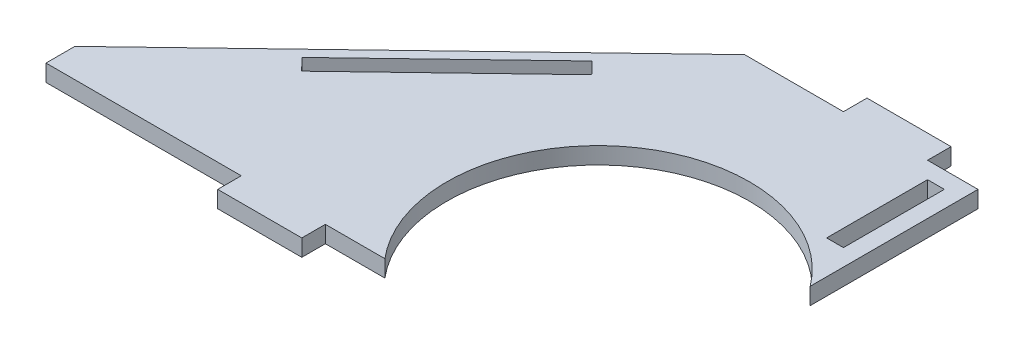
ISO-10303-21;
HEADER;
FILE_DESCRIPTION(('STEP AP214'),'2;1');
FILE_NAME('part.step','',(''),(''),'','','');
FILE_SCHEMA(('AUTOMOTIVE_DESIGN { 1 0 10303 214 1 1 1 1 }'));
ENDSEC;
DATA;
#1=APPLICATION_CONTEXT('core data for automotive mechanical design processes');
#2=APPLICATION_PROTOCOL_DEFINITION('international standard','automotive_design',2000,#1);
#3=PRODUCT_CONTEXT('',#1,'mechanical');
#4=PRODUCT('Part','Part','',(#3));
#5=PRODUCT_RELATED_PRODUCT_CATEGORY('part','',(#4));
#6=PRODUCT_DEFINITION_FORMATION('','',#4);
#7=PRODUCT_DEFINITION_CONTEXT('part definition',#1,'design');
#8=PRODUCT_DEFINITION('design','',#6,#7);
#9=PRODUCT_DEFINITION_SHAPE('','',#8);
#10=(LENGTH_UNIT() NAMED_UNIT(*) SI_UNIT(.MILLI.,.METRE.));
#11=(NAMED_UNIT(*) PLANE_ANGLE_UNIT() SI_UNIT($,.RADIAN.));
#12=(NAMED_UNIT(*) SI_UNIT($,.STERADIAN.) SOLID_ANGLE_UNIT());
#13=UNCERTAINTY_MEASURE_WITH_UNIT(LENGTH_MEASURE(1.E-05),#10,'distance_accuracy_value','');
#14=(GEOMETRIC_REPRESENTATION_CONTEXT(3) GLOBAL_UNCERTAINTY_ASSIGNED_CONTEXT((#13)) GLOBAL_UNIT_ASSIGNED_CONTEXT((#10,
#11,#12)) REPRESENTATION_CONTEXT('',''));
#15=CARTESIAN_POINT('',(0.,0.,0.));
#16=DIRECTION('',(0.,0.,1.));
#17=DIRECTION('',(1.,0.,0.));
#18=AXIS2_PLACEMENT_3D('',#15,#16,#17);
#19=CARTESIAN_POINT('',(0.,5.,0.));
#20=DIRECTION('',(0.,1.,0.));
#21=DIRECTION('',(0.,0.,1.));
#22=AXIS2_PLACEMENT_3D('',#19,#20,#21);
#23=PLANE('',#22);
#24=DIRECTION('',(0.722105065771253,0.,-0.691783401063869));
#25=VECTOR('',#24,1.);
#26=CARTESIAN_POINT('',(-19.5152016277213,5.,-20.3705754333702));
#27=LINE('',#26,#25);
#28=CARTESIAN_POINT('',(-44.4256575245917,5.,3.49387410346132));
#29=VERTEX_POINT('',#28);
#30=CARTESIAN_POINT('',(-0.377248512545201,5.,-38.7049133614347));
#31=VERTEX_POINT('',#30);
#32=EDGE_CURVE('E441',#29,#31,#27,.T.);
#33=ORIENTED_EDGE('',*,*,#32,.T.);
#34=DIRECTION('',(0.691783401063868,0.,0.722105065771255));
#35=VECTOR('',#34,1.);
#36=CARTESIAN_POINT('',(19.1379531151761,5.,-18.3343379280644));
#37=LINE('',#36,#35);
#38=CARTESIAN_POINT('',(3.08166849277414,5.,-35.0943880325784));
#39=VERTEX_POINT('',#38);
#40=EDGE_CURVE('E438',#31,#39,#37,.T.);
#41=ORIENTED_EDGE('',*,*,#40,.T.);
#42=DIRECTION('',(-0.722105065771254,0.,0.691783401063869));
#43=VECTOR('',#42,1.);
#44=CARTESIAN_POINT('',(-16.0562846224019,5.,-16.760050104514));
#45=LINE('',#44,#43);
#46=CARTESIAN_POINT('',(-40.9667405192723,5.,7.10439943231761));
#47=VERTEX_POINT('',#46);
#48=EDGE_CURVE('E419',#39,#47,#45,.T.);
#49=ORIENTED_EDGE('',*,*,#48,.T.);
#50=DIRECTION('',(0.691783401063868,0.,0.722105065771254));
#51=VECTOR('',#50,1.);
#52=CARTESIAN_POINT('',(-24.9104558968704,5.,23.8644495368316));
#53=LINE('',#52,#51);
#54=EDGE_CURVE('E428',#29,#47,#53,.T.);
#55=ORIENTED_EDGE('',*,*,#54,.F.);
#56=EDGE_LOOP('',(#33,#41,#49,#55));
#57=FACE_BOUND('',#56,.T.);
#58=DIRECTION('',(1.,0.,0.));
#59=VECTOR('',#58,1.);
#60=CARTESIAN_POINT('',(0.,5.,-28.));
#61=LINE('',#60,#59);
#62=CARTESIAN_POINT('',(80.,5.,-28.));
#63=VERTEX_POINT('',#62);
#64=CARTESIAN_POINT('',(85.,5.,-28.));
#65=VERTEX_POINT('',#64);
#66=EDGE_CURVE('E392',#63,#65,#61,.T.);
#67=ORIENTED_EDGE('',*,*,#66,.F.);
#68=DIRECTION('',(0.,0.,-1.));
#69=VECTOR('',#68,1.);
#70=CARTESIAN_POINT('',(80.,5.,0.));
#71=LINE('',#70,#69);
#72=CARTESIAN_POINT('',(80.,5.,-58.));
#73=VERTEX_POINT('',#72);
#74=EDGE_CURVE('E402',#63,#73,#71,.T.);
#75=ORIENTED_EDGE('',*,*,#74,.T.);
#76=DIRECTION('',(1.,0.,0.));
#77=VECTOR('',#76,1.);
#78=CARTESIAN_POINT('',(0.,5.,-58.));
#79=LINE('',#78,#77);
#80=CARTESIAN_POINT('',(85.,5.,-58.));
#81=VERTEX_POINT('',#80);
#82=EDGE_CURVE('E412',#73,#81,#79,.T.);
#83=ORIENTED_EDGE('',*,*,#82,.T.);
#84=DIRECTION('',(0.,0.,-1.));
#85=VECTOR('',#84,1.);
#86=CARTESIAN_POINT('',(85.,5.,0.));
#87=LINE('',#86,#85);
#88=EDGE_CURVE('E115',#65,#81,#87,.T.);
#89=ORIENTED_EDGE('',*,*,#88,.F.);
#90=EDGE_LOOP('',(#67,#75,#83,#89));
#91=FACE_BOUND('',#90,.T.);
#92=DIRECTION('',(-0.722105065771254,0.,0.691783401063869));
#93=VECTOR('',#92,1.);
#94=CARTESIAN_POINT('',(-21.5905518309129,5.,-22.536890630684));
#95=LINE('',#94,#93);
#96=CARTESIAN_POINT('',(20.6461023118507,5.,-63.));
#97=VERTEX_POINT('',#96);
#98=CARTESIAN_POINT('',(-81.0413439384418,5.,34.4175237745952));
#99=VERTEX_POINT('',#98);
#100=EDGE_CURVE('E260',#97,#99,#95,.T.);
#101=ORIENTED_EDGE('',*,*,#100,.T.);
#102=DIRECTION('',(0.,0.,1.));
#103=VECTOR('',#102,1.);
#104=CARTESIAN_POINT('',(-81.0413439384418,5.,0.));
#105=LINE('',#104,#103);
#106=CARTESIAN_POINT('',(-81.0413439384418,5.,43.));
#107=VERTEX_POINT('',#106);
#108=EDGE_CURVE('E107',#99,#107,#105,.T.);
#109=ORIENTED_EDGE('',*,*,#108,.T.);
#110=DIRECTION('',(1.,0.,0.));
#111=VECTOR('',#110,1.);
#112=CARTESIAN_POINT('',(0.,5.,43.));
#113=LINE('',#112,#111);
#114=CARTESIAN_POINT('',(-23.,5.,43.));
#115=VERTEX_POINT('',#114);
#116=EDGE_CURVE('E290',#107,#115,#113,.T.);
#117=ORIENTED_EDGE('',*,*,#116,.T.);
#118=DIRECTION('',(0.,0.,1.));
#119=VECTOR('',#118,1.);
#120=CARTESIAN_POINT('',(-23.,5.,0.));
#121=LINE('',#120,#119);
#122=CARTESIAN_POINT('',(-23.,5.,50.));
#123=VERTEX_POINT('',#122);
#124=EDGE_CURVE('E292',#115,#123,#121,.T.);
#125=ORIENTED_EDGE('',*,*,#124,.T.);
#126=DIRECTION('',(1.,0.,0.));
#127=VECTOR('',#126,1.);
#128=CARTESIAN_POINT('',(0.,5.,50.));
#129=LINE('',#128,#127);
#130=CARTESIAN_POINT('',(2.00000000000002,5.,50.));
#131=VERTEX_POINT('',#130);
#132=EDGE_CURVE('E294',#123,#131,#129,.T.);
#133=ORIENTED_EDGE('',*,*,#132,.T.);
#134=DIRECTION('',(0.,0.,1.));
#135=VECTOR('',#134,1.);
#136=CARTESIAN_POINT('',(2.00000000000002,5.,0.));
#137=LINE('',#136,#135);
#138=CARTESIAN_POINT('',(2.00000000000002,5.,43.));
#139=VERTEX_POINT('',#138);
#140=EDGE_CURVE('E296',#139,#131,#137,.T.);
#141=ORIENTED_EDGE('',*,*,#140,.F.);
#142=DIRECTION('',(-1.,0.,0.));
#143=VECTOR('',#142,1.);
#144=CARTESIAN_POINT('',(0.,5.,43.));
#145=LINE('',#144,#143);
#146=CARTESIAN_POINT('',(19.6906989318297,5.,43.));
#147=VERTEX_POINT('',#146);
#148=EDGE_CURVE('E299',#147,#139,#145,.T.);
#149=ORIENTED_EDGE('',*,*,#148,.F.);
#150=CARTESIAN_POINT('',(54.1000000000003,5.,14.));
#151=DIRECTION('',(0.,1.,0.));
#152=DIRECTION('',(0.,0.,1.));
#153=AXIS2_PLACEMENT_3D('',#150,#151,#152);
#154=CIRCLE('',#153,45.);
#155=CARTESIAN_POINT('',(90.,5.,-13.1328214529934));
#156=VERTEX_POINT('',#155);
#157=EDGE_CURVE('E270',#156,#147,#154,.T.);
#158=ORIENTED_EDGE('',*,*,#157,.F.);
#159=DIRECTION('',(0.,0.,1.));
#160=VECTOR('',#159,1.);
#161=CARTESIAN_POINT('',(90.,5.,0.));
#162=LINE('',#161,#160);
#163=CARTESIAN_POINT('',(90.,5.,-63.));
#164=VERTEX_POINT('',#163);
#165=EDGE_CURVE('E273',#164,#156,#162,.T.);
#166=ORIENTED_EDGE('',*,*,#165,.F.);
#167=DIRECTION('',(1.,0.,0.));
#168=VECTOR('',#167,1.);
#169=CARTESIAN_POINT('',(0.,5.,-63.));
#170=LINE('',#169,#168);
#171=CARTESIAN_POINT('',(75.,5.,-63.));
#172=VERTEX_POINT('',#171);
#173=EDGE_CURVE('E277',#172,#164,#170,.T.);
#174=ORIENTED_EDGE('',*,*,#173,.F.);
#175=DIRECTION('',(0.,0.,-1.));
#176=VECTOR('',#175,1.);
#177=CARTESIAN_POINT('',(75.,5.,0.));
#178=LINE('',#177,#176);
#179=CARTESIAN_POINT('',(75.,5.,-70.));
#180=VERTEX_POINT('',#179);
#181=EDGE_CURVE('E280',#172,#180,#178,.T.);
#182=ORIENTED_EDGE('',*,*,#181,.T.);
#183=DIRECTION('',(1.,0.,0.));
#184=VECTOR('',#183,1.);
#185=CARTESIAN_POINT('',(0.,5.,-70.));
#186=LINE('',#185,#184);
#187=CARTESIAN_POINT('',(50.,5.,-70.));
#188=VERTEX_POINT('',#187);
#189=EDGE_CURVE('E282',#188,#180,#186,.T.);
#190=ORIENTED_EDGE('',*,*,#189,.F.);
#191=DIRECTION('',(0.,0.,-1.));
#192=VECTOR('',#191,1.);
#193=CARTESIAN_POINT('',(50.,5.,0.));
#194=LINE('',#193,#192);
#195=CARTESIAN_POINT('',(50.,5.,-63.));
#196=VERTEX_POINT('',#195);
#197=EDGE_CURVE('E285',#196,#188,#194,.T.);
#198=ORIENTED_EDGE('',*,*,#197,.F.);
#199=DIRECTION('',(1.,0.,0.));
#200=VECTOR('',#199,1.);
#201=CARTESIAN_POINT('',(0.,5.,-63.));
#202=LINE('',#201,#200);
#203=EDGE_CURVE('E288',#97,#196,#202,.T.);
#204=ORIENTED_EDGE('',*,*,#203,.F.);
#205=EDGE_LOOP('',(#101,#109,#117,#125,#133,#141,#149,#158,#166,#174,#182,#190,#198,#204));
#206=FACE_BOUND('',#205,.T.);
#207=ADVANCED_FACE('F92',(#57,#91,#206),#23,.T.);
#208=CARTESIAN_POINT('',(0.,0.,0.));
#209=DIRECTION('',(0.,1.,0.));
#210=DIRECTION('',(0.,0.,1.));
#211=AXIS2_PLACEMENT_3D('',#208,#209,#210);
#212=PLANE('',#211);
#213=DIRECTION('',(0.,0.,-1.));
#214=VECTOR('',#213,1.);
#215=CARTESIAN_POINT('',(80.,0.,0.));
#216=LINE('',#215,#214);
#217=CARTESIAN_POINT('',(80.,0.,-28.));
#218=VERTEX_POINT('',#217);
#219=CARTESIAN_POINT('',(80.,0.,-58.));
#220=VERTEX_POINT('',#219);
#221=EDGE_CURVE('E407',#218,#220,#216,.T.);
#222=ORIENTED_EDGE('',*,*,#221,.F.);
#223=DIRECTION('',(1.,0.,0.));
#224=VECTOR('',#223,1.);
#225=CARTESIAN_POINT('',(0.,0.,-28.));
#226=LINE('',#225,#224);
#227=CARTESIAN_POINT('',(85.,0.,-28.));
#228=VERTEX_POINT('',#227);
#229=EDGE_CURVE('E398',#218,#228,#226,.T.);
#230=ORIENTED_EDGE('',*,*,#229,.T.);
#231=DIRECTION('',(0.,0.,-1.));
#232=VECTOR('',#231,1.);
#233=CARTESIAN_POINT('',(85.,0.,0.));
#234=LINE('',#233,#232);
#235=CARTESIAN_POINT('',(85.,0.,-58.));
#236=VERTEX_POINT('',#235);
#237=EDGE_CURVE('E401',#228,#236,#234,.T.);
#238=ORIENTED_EDGE('',*,*,#237,.T.);
#239=DIRECTION('',(1.,0.,0.));
#240=VECTOR('',#239,1.);
#241=CARTESIAN_POINT('',(0.,0.,-58.));
#242=LINE('',#241,#240);
#243=EDGE_CURVE('E405',#220,#236,#242,.T.);
#244=ORIENTED_EDGE('',*,*,#243,.F.);
#245=EDGE_LOOP('',(#222,#230,#238,#244));
#246=FACE_BOUND('',#245,.T.);
#247=DIRECTION('',(0.691783401063868,0.,0.722105065771255));
#248=VECTOR('',#247,1.);
#249=CARTESIAN_POINT('',(19.1379531151761,0.,-18.3343379280644));
#250=LINE('',#249,#248);
#251=CARTESIAN_POINT('',(-0.377248512545201,0.,-38.7049133614347));
#252=VERTEX_POINT('',#251);
#253=CARTESIAN_POINT('',(3.08166849277414,0.,-35.0943880325784));
#254=VERTEX_POINT('',#253);
#255=EDGE_CURVE('E427',#252,#254,#250,.T.);
#256=ORIENTED_EDGE('',*,*,#255,.F.);
#257=DIRECTION('',(0.722105065771253,0.,-0.691783401063869));
#258=VECTOR('',#257,1.);
#259=CARTESIAN_POINT('',(-19.5152016277213,0.,-20.3705754333702));
#260=LINE('',#259,#258);
#261=CARTESIAN_POINT('',(-44.4256575245917,0.,3.49387410346132));
#262=VERTEX_POINT('',#261);
#263=EDGE_CURVE('E431',#262,#252,#260,.T.);
#264=ORIENTED_EDGE('',*,*,#263,.F.);
#265=DIRECTION('',(0.691783401063868,0.,0.722105065771254));
#266=VECTOR('',#265,1.);
#267=CARTESIAN_POINT('',(-24.9104558968704,0.,23.8644495368316));
#268=LINE('',#267,#266);
#269=CARTESIAN_POINT('',(-40.9667405192723,0.,7.10439943231759));
#270=VERTEX_POINT('',#269);
#271=EDGE_CURVE('E433',#262,#270,#268,.T.);
#272=ORIENTED_EDGE('',*,*,#271,.T.);
#273=DIRECTION('',(-0.722105065771254,0.,0.691783401063869));
#274=VECTOR('',#273,1.);
#275=CARTESIAN_POINT('',(-16.0562846224019,0.,-16.760050104514));
#276=LINE('',#275,#274);
#277=EDGE_CURVE('E425',#254,#270,#276,.T.);
#278=ORIENTED_EDGE('',*,*,#277,.F.);
#279=EDGE_LOOP('',(#256,#264,#272,#278));
#280=FACE_BOUND('',#279,.T.);
#281=DIRECTION('',(0.,0.,1.));
#282=VECTOR('',#281,1.);
#283=CARTESIAN_POINT('',(-81.0413439384418,0.,0.));
#284=LINE('',#283,#282);
#285=CARTESIAN_POINT('',(-81.0413439384418,0.,34.4175237745952));
#286=VERTEX_POINT('',#285);
#287=CARTESIAN_POINT('',(-81.0413439384418,0.,43.));
#288=VERTEX_POINT('',#287);
#289=EDGE_CURVE('E241',#286,#288,#284,.T.);
#290=ORIENTED_EDGE('',*,*,#289,.F.);
#291=DIRECTION('',(-0.722105065771254,0.,0.691783401063869));
#292=VECTOR('',#291,1.);
#293=CARTESIAN_POINT('',(-21.5905518309129,0.,-22.536890630684));
#294=LINE('',#293,#292);
#295=CARTESIAN_POINT('',(20.6461023118507,0.,-63.));
#296=VERTEX_POINT('',#295);
#297=EDGE_CURVE('E252',#296,#286,#294,.T.);
#298=ORIENTED_EDGE('',*,*,#297,.F.);
#299=DIRECTION('',(1.,0.,0.));
#300=VECTOR('',#299,1.);
#301=CARTESIAN_POINT('',(0.,0.,-63.));
#302=LINE('',#301,#300);
#303=CARTESIAN_POINT('',(50.,0.,-63.));
#304=VERTEX_POINT('',#303);
#305=EDGE_CURVE('E320',#296,#304,#302,.T.);
#306=ORIENTED_EDGE('',*,*,#305,.T.);
#307=DIRECTION('',(0.,0.,-1.));
#308=VECTOR('',#307,1.);
#309=CARTESIAN_POINT('',(50.,0.,0.));
#310=LINE('',#309,#308);
#311=CARTESIAN_POINT('',(50.,0.,-70.));
#312=VERTEX_POINT('',#311);
#313=EDGE_CURVE('E317',#304,#312,#310,.T.);
#314=ORIENTED_EDGE('',*,*,#313,.T.);
#315=DIRECTION('',(1.,0.,0.));
#316=VECTOR('',#315,1.);
#317=CARTESIAN_POINT('',(0.,0.,-70.));
#318=LINE('',#317,#316);
#319=CARTESIAN_POINT('',(75.,0.,-70.));
#320=VERTEX_POINT('',#319);
#321=EDGE_CURVE('E314',#312,#320,#318,.T.);
#322=ORIENTED_EDGE('',*,*,#321,.T.);
#323=DIRECTION('',(0.,0.,-1.));
#324=VECTOR('',#323,1.);
#325=CARTESIAN_POINT('',(75.,0.,0.));
#326=LINE('',#325,#324);
#327=CARTESIAN_POINT('',(75.,0.,-63.));
#328=VERTEX_POINT('',#327);
#329=EDGE_CURVE('E311',#328,#320,#326,.T.);
#330=ORIENTED_EDGE('',*,*,#329,.F.);
#331=DIRECTION('',(1.,0.,0.));
#332=VECTOR('',#331,1.);
#333=CARTESIAN_POINT('',(0.,0.,-63.));
#334=LINE('',#333,#332);
#335=CARTESIAN_POINT('',(90.,0.,-63.));
#336=VERTEX_POINT('',#335);
#337=EDGE_CURVE('E308',#328,#336,#334,.T.);
#338=ORIENTED_EDGE('',*,*,#337,.T.);
#339=DIRECTION('',(0.,0.,1.));
#340=VECTOR('',#339,1.);
#341=CARTESIAN_POINT('',(90.,0.,0.));
#342=LINE('',#341,#340);
#343=CARTESIAN_POINT('',(90.,0.,-13.1328214529934));
#344=VERTEX_POINT('',#343);
#345=EDGE_CURVE('E305',#336,#344,#342,.T.);
#346=ORIENTED_EDGE('',*,*,#345,.T.);
#347=CARTESIAN_POINT('',(54.1000000000003,0.,14.));
#348=DIRECTION('',(0.,1.,0.));
#349=DIRECTION('',(0.,0.,1.));
#350=AXIS2_PLACEMENT_3D('',#347,#348,#349);
#351=CIRCLE('',#350,45.);
#352=CARTESIAN_POINT('',(19.6906989318297,0.,43.));
#353=VERTEX_POINT('',#352);
#354=EDGE_CURVE('E262',#344,#353,#351,.T.);
#355=ORIENTED_EDGE('',*,*,#354,.T.);
#356=DIRECTION('',(-1.,0.,0.));
#357=VECTOR('',#356,1.);
#358=CARTESIAN_POINT('',(0.,0.,43.));
#359=LINE('',#358,#357);
#360=CARTESIAN_POINT('',(2.00000000000002,0.,43.));
#361=VERTEX_POINT('',#360);
#362=EDGE_CURVE('E274',#353,#361,#359,.T.);
#363=ORIENTED_EDGE('',*,*,#362,.T.);
#364=DIRECTION('',(0.,0.,1.));
#365=VECTOR('',#364,1.);
#366=CARTESIAN_POINT('',(2.00000000000002,0.,0.));
#367=LINE('',#366,#365);
#368=CARTESIAN_POINT('',(2.00000000000002,0.,50.));
#369=VERTEX_POINT('',#368);
#370=EDGE_CURVE('E328',#361,#369,#367,.T.);
#371=ORIENTED_EDGE('',*,*,#370,.T.);
#372=DIRECTION('',(1.,0.,0.));
#373=VECTOR('',#372,1.);
#374=CARTESIAN_POINT('',(0.,0.,50.));
#375=LINE('',#374,#373);
#376=CARTESIAN_POINT('',(-23.,0.,50.));
#377=VERTEX_POINT('',#376);
#378=EDGE_CURVE('E325',#377,#369,#375,.T.);
#379=ORIENTED_EDGE('',*,*,#378,.F.);
#380=DIRECTION('',(0.,0.,1.));
#381=VECTOR('',#380,1.);
#382=CARTESIAN_POINT('',(-23.,0.,0.));
#383=LINE('',#382,#381);
#384=CARTESIAN_POINT('',(-23.,0.,43.));
#385=VERTEX_POINT('',#384);
#386=EDGE_CURVE('E323',#385,#377,#383,.T.);
#387=ORIENTED_EDGE('',*,*,#386,.F.);
#388=DIRECTION('',(1.,0.,0.));
#389=VECTOR('',#388,1.);
#390=CARTESIAN_POINT('',(0.,0.,43.));
#391=LINE('',#390,#389);
#392=EDGE_CURVE('E255',#288,#385,#391,.T.);
#393=ORIENTED_EDGE('',*,*,#392,.F.);
#394=EDGE_LOOP('',(#290,#298,#306,#314,#322,#330,#338,#346,#355,#363,#371,#379,#387,#393));
#395=FACE_BOUND('',#394,.T.);
#396=ADVANCED_FACE('F251',(#246,#280,#395),#212,.F.);
#397=CARTESIAN_POINT('',(0.,5.,43.));
#398=DIRECTION('',(0.,0.,-1.));
#399=DIRECTION('',(-1.,0.,0.));
#400=AXIS2_PLACEMENT_3D('',#397,#398,#399);
#401=PLANE('',#400);
#402=DIRECTION('',(0.,1.,0.));
#403=VECTOR('',#402,1.);
#404=CARTESIAN_POINT('',(-81.0413439384418,0.,43.));
#405=LINE('',#404,#403);
#406=EDGE_CURVE('E246',#288,#107,#405,.T.);
#407=ORIENTED_EDGE('',*,*,#406,.F.);
#408=ORIENTED_EDGE('',*,*,#392,.T.);
#409=DIRECTION('',(0.,-1.,0.));
#410=VECTOR('',#409,1.);
#411=CARTESIAN_POINT('',(-23.,5.,43.));
#412=LINE('',#411,#410);
#413=EDGE_CURVE('E341',#115,#385,#412,.T.);
#414=ORIENTED_EDGE('',*,*,#413,.F.);
#415=ORIENTED_EDGE('',*,*,#116,.F.);
#416=EDGE_LOOP('',(#407,#408,#414,#415));
#417=FACE_BOUND('',#416,.T.);
#418=ADVANCED_FACE('F391',(#417),#401,.F.);
#419=CARTESIAN_POINT('',(-21.5905518309129,0.,-22.536890630684));
#420=DIRECTION('',(-0.691783401063869,0.,-0.722105065771254));
#421=DIRECTION('',(-0.722105065771254,0.,0.691783401063869));
#422=AXIS2_PLACEMENT_3D('',#419,#420,#421);
#423=PLANE('',#422);
#424=ORIENTED_EDGE('',*,*,#297,.T.);
#425=DIRECTION('',(0.,1.,0.));
#426=VECTOR('',#425,1.);
#427=CARTESIAN_POINT('',(-81.0413439384418,0.,34.4175237745952));
#428=LINE('',#427,#426);
#429=EDGE_CURVE('E238',#286,#99,#428,.T.);
#430=ORIENTED_EDGE('',*,*,#429,.T.);
#431=ORIENTED_EDGE('',*,*,#100,.F.);
#432=DIRECTION('',(0.,1.,0.));
#433=VECTOR('',#432,1.);
#434=CARTESIAN_POINT('',(20.6461023118507,0.,-63.));
#435=LINE('',#434,#433);
#436=EDGE_CURVE('E259',#296,#97,#435,.T.);
#437=ORIENTED_EDGE('',*,*,#436,.F.);
#438=EDGE_LOOP('',(#424,#430,#431,#437));
#439=FACE_BOUND('',#438,.T.);
#440=ADVANCED_FACE('F257',(#439),#423,.T.);
#441=CARTESIAN_POINT('',(0.,5.,-63.));
#442=DIRECTION('',(0.,0.,-1.));
#443=DIRECTION('',(-1.,0.,0.));
#444=AXIS2_PLACEMENT_3D('',#441,#442,#443);
#445=PLANE('',#444);
#446=ORIENTED_EDGE('',*,*,#305,.F.);
#447=ORIENTED_EDGE('',*,*,#436,.T.);
#448=ORIENTED_EDGE('',*,*,#203,.T.);
#449=DIRECTION('',(0.,-1.,0.));
#450=VECTOR('',#449,1.);
#451=CARTESIAN_POINT('',(50.,5.,-63.));
#452=LINE('',#451,#450);
#453=EDGE_CURVE('E344',#196,#304,#452,.T.);
#454=ORIENTED_EDGE('',*,*,#453,.T.);
#455=EDGE_LOOP('',(#446,#447,#448,#454));
#456=FACE_BOUND('',#455,.T.);
#457=ADVANCED_FACE('F491',(#456),#445,.T.);
#458=CARTESIAN_POINT('',(54.1000000000003,5.,14.));
#459=DIRECTION('',(0.,-1.,0.));
#460=DIRECTION('',(0.,0.,-1.));
#461=AXIS2_PLACEMENT_3D('',#458,#459,#460);
#462=CYLINDRICAL_SURFACE('',#461,45.);
#463=ORIENTED_EDGE('',*,*,#354,.F.);
#464=DIRECTION('',(0.,-1.,0.));
#465=VECTOR('',#464,1.);
#466=CARTESIAN_POINT('',(90.,5.,-13.1328214529934));
#467=LINE('',#466,#465);
#468=EDGE_CURVE('E12',#156,#344,#467,.T.);
#469=ORIENTED_EDGE('',*,*,#468,.F.);
#470=ORIENTED_EDGE('',*,*,#157,.T.);
#471=DIRECTION('',(0.,-1.,0.));
#472=VECTOR('',#471,1.);
#473=CARTESIAN_POINT('',(19.6906989318297,5.,43.));
#474=LINE('',#473,#472);
#475=EDGE_CURVE('E302',#147,#353,#474,.T.);
#476=ORIENTED_EDGE('',*,*,#475,.T.);
#477=EDGE_LOOP('',(#463,#469,#470,#476));
#478=FACE_BOUND('',#477,.T.);
#479=ADVANCED_FACE('F94',(#478),#462,.F.);
#480=CARTESIAN_POINT('',(90.,5.,0.));
#481=DIRECTION('',(1.,0.,0.));
#482=DIRECTION('',(0.,0.,-1.));
#483=AXIS2_PLACEMENT_3D('',#480,#481,#482);
#484=PLANE('',#483);
#485=ORIENTED_EDGE('',*,*,#345,.F.);
#486=DIRECTION('',(0.,-1.,0.));
#487=VECTOR('',#486,1.);
#488=CARTESIAN_POINT('',(90.,5.,-63.));
#489=LINE('',#488,#487);
#490=EDGE_CURVE('E100',#164,#336,#489,.T.);
#491=ORIENTED_EDGE('',*,*,#490,.F.);
#492=ORIENTED_EDGE('',*,*,#165,.T.);
#493=ORIENTED_EDGE('',*,*,#468,.T.);
#494=EDGE_LOOP('',(#485,#491,#492,#493));
#495=FACE_BOUND('',#494,.T.);
#496=ADVANCED_FACE('F359',(#495),#484,.T.);
#497=CARTESIAN_POINT('',(0.,5.,-63.));
#498=DIRECTION('',(0.,0.,-1.));
#499=DIRECTION('',(-1.,0.,0.));
#500=AXIS2_PLACEMENT_3D('',#497,#498,#499);
#501=PLANE('',#500);
#502=ORIENTED_EDGE('',*,*,#337,.F.);
#503=DIRECTION('',(0.,-1.,0.));
#504=VECTOR('',#503,1.);
#505=CARTESIAN_POINT('',(75.,5.,-63.));
#506=LINE('',#505,#504);
#507=EDGE_CURVE('E351',#172,#328,#506,.T.);
#508=ORIENTED_EDGE('',*,*,#507,.F.);
#509=ORIENTED_EDGE('',*,*,#173,.T.);
#510=ORIENTED_EDGE('',*,*,#490,.T.);
#511=EDGE_LOOP('',(#502,#508,#509,#510));
#512=FACE_BOUND('',#511,.T.);
#513=ADVANCED_FACE('F355',(#512),#501,.T.);
#514=CARTESIAN_POINT('',(75.,5.,0.));
#515=DIRECTION('',(-1.,0.,0.));
#516=DIRECTION('',(0.,0.,1.));
#517=AXIS2_PLACEMENT_3D('',#514,#515,#516);
#518=PLANE('',#517);
#519=ORIENTED_EDGE('',*,*,#329,.T.);
#520=DIRECTION('',(0.,-1.,0.));
#521=VECTOR('',#520,1.);
#522=CARTESIAN_POINT('',(75.,5.,-70.));
#523=LINE('',#522,#521);
#524=EDGE_CURVE('E349',#180,#320,#523,.T.);
#525=ORIENTED_EDGE('',*,*,#524,.F.);
#526=ORIENTED_EDGE('',*,*,#181,.F.);
#527=ORIENTED_EDGE('',*,*,#507,.T.);
#528=EDGE_LOOP('',(#519,#525,#526,#527));
#529=FACE_BOUND('',#528,.T.);
#530=ADVANCED_FACE('F365',(#529),#518,.F.);
#531=CARTESIAN_POINT('',(0.,5.,-70.));
#532=DIRECTION('',(0.,0.,-1.));
#533=DIRECTION('',(-1.,0.,0.));
#534=AXIS2_PLACEMENT_3D('',#531,#532,#533);
#535=PLANE('',#534);
#536=ORIENTED_EDGE('',*,*,#321,.F.);
#537=DIRECTION('',(0.,-1.,0.));
#538=VECTOR('',#537,1.);
#539=CARTESIAN_POINT('',(50.,5.,-70.));
#540=LINE('',#539,#538);
#541=EDGE_CURVE('E347',#188,#312,#540,.T.);
#542=ORIENTED_EDGE('',*,*,#541,.F.);
#543=ORIENTED_EDGE('',*,*,#189,.T.);
#544=ORIENTED_EDGE('',*,*,#524,.T.);
#545=EDGE_LOOP('',(#536,#542,#543,#544));
#546=FACE_BOUND('',#545,.T.);
#547=ADVANCED_FACE('F497',(#546),#535,.T.);
#548=CARTESIAN_POINT('',(50.,5.,0.));
#549=DIRECTION('',(-1.,0.,0.));
#550=DIRECTION('',(0.,0.,1.));
#551=AXIS2_PLACEMENT_3D('',#548,#549,#550);
#552=PLANE('',#551);
#553=ORIENTED_EDGE('',*,*,#313,.F.);
#554=ORIENTED_EDGE('',*,*,#453,.F.);
#555=ORIENTED_EDGE('',*,*,#197,.T.);
#556=ORIENTED_EDGE('',*,*,#541,.T.);
#557=EDGE_LOOP('',(#553,#554,#555,#556));
#558=FACE_BOUND('',#557,.T.);
#559=ADVANCED_FACE('F489',(#558),#552,.T.);
#560=CARTESIAN_POINT('',(-23.,5.,0.));
#561=DIRECTION('',(1.,0.,0.));
#562=DIRECTION('',(0.,0.,-1.));
#563=AXIS2_PLACEMENT_3D('',#560,#561,#562);
#564=PLANE('',#563);
#565=ORIENTED_EDGE('',*,*,#386,.T.);
#566=DIRECTION('',(0.,-1.,0.));
#567=VECTOR('',#566,1.);
#568=CARTESIAN_POINT('',(-23.,5.,50.));
#569=LINE('',#568,#567);
#570=EDGE_CURVE('E338',#123,#377,#569,.T.);
#571=ORIENTED_EDGE('',*,*,#570,.F.);
#572=ORIENTED_EDGE('',*,*,#124,.F.);
#573=ORIENTED_EDGE('',*,*,#413,.T.);
#574=EDGE_LOOP('',(#565,#571,#572,#573));
#575=FACE_BOUND('',#574,.T.);
#576=ADVANCED_FACE('F387',(#575),#564,.F.);
#577=CARTESIAN_POINT('',(0.,5.,50.));
#578=DIRECTION('',(0.,0.,-1.));
#579=DIRECTION('',(-1.,0.,0.));
#580=AXIS2_PLACEMENT_3D('',#577,#578,#579);
#581=PLANE('',#580);
#582=ORIENTED_EDGE('',*,*,#378,.T.);
#583=DIRECTION('',(0.,-1.,0.));
#584=VECTOR('',#583,1.);
#585=CARTESIAN_POINT('',(2.00000000000002,5.,50.));
#586=LINE('',#585,#584);
#587=EDGE_CURVE('E336',#131,#369,#586,.T.);
#588=ORIENTED_EDGE('',*,*,#587,.F.);
#589=ORIENTED_EDGE('',*,*,#132,.F.);
#590=ORIENTED_EDGE('',*,*,#570,.T.);
#591=EDGE_LOOP('',(#582,#588,#589,#590));
#592=FACE_BOUND('',#591,.T.);
#593=ADVANCED_FACE('F382',(#592),#581,.F.);
#594=CARTESIAN_POINT('',(2.00000000000002,5.,0.));
#595=DIRECTION('',(1.,0.,0.));
#596=DIRECTION('',(0.,0.,-1.));
#597=AXIS2_PLACEMENT_3D('',#594,#595,#596);
#598=PLANE('',#597);
#599=ORIENTED_EDGE('',*,*,#370,.F.);
#600=DIRECTION('',(0.,-1.,0.));
#601=VECTOR('',#600,1.);
#602=CARTESIAN_POINT('',(2.00000000000002,5.,43.));
#603=LINE('',#602,#601);
#604=EDGE_CURVE('E334',#139,#361,#603,.T.);
#605=ORIENTED_EDGE('',*,*,#604,.F.);
#606=ORIENTED_EDGE('',*,*,#140,.T.);
#607=ORIENTED_EDGE('',*,*,#587,.T.);
#608=EDGE_LOOP('',(#599,#605,#606,#607));
#609=FACE_BOUND('',#608,.T.);
#610=ADVANCED_FACE('F378',(#609),#598,.T.);
#611=CARTESIAN_POINT('',(0.,5.,43.));
#612=DIRECTION('',(0.,0.,1.));
#613=DIRECTION('',(1.,0.,0.));
#614=AXIS2_PLACEMENT_3D('',#611,#612,#613);
#615=PLANE('',#614);
#616=ORIENTED_EDGE('',*,*,#362,.F.);
#617=ORIENTED_EDGE('',*,*,#475,.F.);
#618=ORIENTED_EDGE('',*,*,#148,.T.);
#619=ORIENTED_EDGE('',*,*,#604,.T.);
#620=EDGE_LOOP('',(#616,#617,#618,#619));
#621=FACE_BOUND('',#620,.T.);
#622=ADVANCED_FACE('F375',(#621),#615,.T.);
#623=CARTESIAN_POINT('',(19.1379531151761,0.,-18.3343379280644));
#624=DIRECTION('',(-0.722105065771255,0.,0.691783401063868));
#625=DIRECTION('',(0.691783401063868,0.,0.722105065771255));
#626=AXIS2_PLACEMENT_3D('',#623,#624,#625);
#627=PLANE('',#626);
#628=ORIENTED_EDGE('',*,*,#40,.F.);
#629=DIRECTION('',(0.,1.,0.));
#630=VECTOR('',#629,1.);
#631=CARTESIAN_POINT('',(-0.377248512545201,0.,-38.7049133614347));
#632=LINE('',#631,#630);
#633=EDGE_CURVE('E448',#252,#31,#632,.T.);
#634=ORIENTED_EDGE('',*,*,#633,.F.);
#635=ORIENTED_EDGE('',*,*,#255,.T.);
#636=DIRECTION('',(0.,1.,0.));
#637=VECTOR('',#636,1.);
#638=CARTESIAN_POINT('',(3.08166849277414,0.,-35.0943880325784));
#639=LINE('',#638,#637);
#640=EDGE_CURVE('E267',#254,#39,#639,.T.);
#641=ORIENTED_EDGE('',*,*,#640,.T.);
#642=EDGE_LOOP('',(#628,#634,#635,#641));
#643=FACE_BOUND('',#642,.T.);
#644=ADVANCED_FACE('F455',(#643),#627,.T.);
#645=CARTESIAN_POINT('',(-19.5152016277213,0.,-20.3705754333702));
#646=DIRECTION('',(0.691783401063869,0.,0.722105065771253));
#647=DIRECTION('',(0.722105065771253,0.,-0.691783401063869));
#648=AXIS2_PLACEMENT_3D('',#645,#646,#647);
#649=PLANE('',#648);
#650=ORIENTED_EDGE('',*,*,#32,.F.);
#651=DIRECTION('',(0.,1.,0.));
#652=VECTOR('',#651,1.);
#653=CARTESIAN_POINT('',(-44.4256575245917,0.,3.49387410346132));
#654=LINE('',#653,#652);
#655=EDGE_CURVE('E447',#262,#29,#654,.T.);
#656=ORIENTED_EDGE('',*,*,#655,.F.);
#657=ORIENTED_EDGE('',*,*,#263,.T.);
#658=ORIENTED_EDGE('',*,*,#633,.T.);
#659=EDGE_LOOP('',(#650,#656,#657,#658));
#660=FACE_BOUND('',#659,.T.);
#661=ADVANCED_FACE('F464',(#660),#649,.T.);
#662=CARTESIAN_POINT('',(-24.9104558968704,0.,23.8644495368316));
#663=DIRECTION('',(-0.722105065771254,0.,0.691783401063868));
#664=DIRECTION('',(0.691783401063868,0.,0.722105065771254));
#665=AXIS2_PLACEMENT_3D('',#662,#663,#664);
#666=PLANE('',#665);
#667=ORIENTED_EDGE('',*,*,#54,.T.);
#668=DIRECTION('',(0.,1.,0.));
#669=VECTOR('',#668,1.);
#670=CARTESIAN_POINT('',(-40.9667405192723,0.,7.10439943231759));
#671=LINE('',#670,#669);
#672=EDGE_CURVE('E264',#270,#47,#671,.T.);
#673=ORIENTED_EDGE('',*,*,#672,.F.);
#674=ORIENTED_EDGE('',*,*,#271,.F.);
#675=ORIENTED_EDGE('',*,*,#655,.T.);
#676=EDGE_LOOP('',(#667,#673,#674,#675));
#677=FACE_BOUND('',#676,.T.);
#678=ADVANCED_FACE('F468',(#677),#666,.F.);
#679=CARTESIAN_POINT('',(-16.0562846224019,0.,-16.760050104514));
#680=DIRECTION('',(-0.691783401063869,0.,-0.722105065771254));
#681=DIRECTION('',(-0.722105065771254,0.,0.691783401063869));
#682=AXIS2_PLACEMENT_3D('',#679,#680,#681);
#683=PLANE('',#682);
#684=ORIENTED_EDGE('',*,*,#48,.F.);
#685=ORIENTED_EDGE('',*,*,#640,.F.);
#686=ORIENTED_EDGE('',*,*,#277,.T.);
#687=ORIENTED_EDGE('',*,*,#672,.T.);
#688=EDGE_LOOP('',(#684,#685,#686,#687));
#689=FACE_BOUND('',#688,.T.);
#690=ADVANCED_FACE('F459',(#689),#683,.T.);
#691=CARTESIAN_POINT('',(80.,0.,0.));
#692=DIRECTION('',(1.,0.,0.));
#693=DIRECTION('',(0.,0.,-1.));
#694=AXIS2_PLACEMENT_3D('',#691,#692,#693);
#695=PLANE('',#694);
#696=ORIENTED_EDGE('',*,*,#74,.F.);
#697=DIRECTION('',(0.,1.,0.));
#698=VECTOR('',#697,1.);
#699=CARTESIAN_POINT('',(80.,0.,-28.));
#700=LINE('',#699,#698);
#701=EDGE_CURVE('E417',#218,#63,#700,.T.);
#702=ORIENTED_EDGE('',*,*,#701,.F.);
#703=ORIENTED_EDGE('',*,*,#221,.T.);
#704=DIRECTION('',(0.,1.,0.));
#705=VECTOR('',#704,1.);
#706=CARTESIAN_POINT('',(80.,0.,-58.));
#707=LINE('',#706,#705);
#708=EDGE_CURVE('E420',#220,#73,#707,.T.);
#709=ORIENTED_EDGE('',*,*,#708,.T.);
#710=EDGE_LOOP('',(#696,#702,#703,#709));
#711=FACE_BOUND('',#710,.T.);
#712=ADVANCED_FACE('F570',(#711),#695,.T.);
#713=CARTESIAN_POINT('',(0.,0.,-28.));
#714=DIRECTION('',(0.,0.,1.));
#715=DIRECTION('',(1.,0.,0.));
#716=AXIS2_PLACEMENT_3D('',#713,#714,#715);
#717=PLANE('',#716);
#718=ORIENTED_EDGE('',*,*,#66,.T.);
#719=DIRECTION('',(0.,1.,0.));
#720=VECTOR('',#719,1.);
#721=CARTESIAN_POINT('',(85.,0.,-28.));
#722=LINE('',#721,#720);
#723=EDGE_CURVE('E409',#228,#65,#722,.T.);
#724=ORIENTED_EDGE('',*,*,#723,.F.);
#725=ORIENTED_EDGE('',*,*,#229,.F.);
#726=ORIENTED_EDGE('',*,*,#701,.T.);
#727=EDGE_LOOP('',(#718,#724,#725,#726));
#728=FACE_BOUND('',#727,.T.);
#729=ADVANCED_FACE('F560',(#728),#717,.F.);
#730=CARTESIAN_POINT('',(85.,0.,0.));
#731=DIRECTION('',(1.,0.,0.));
#732=DIRECTION('',(0.,0.,-1.));
#733=AXIS2_PLACEMENT_3D('',#730,#731,#732);
#734=PLANE('',#733);
#735=ORIENTED_EDGE('',*,*,#88,.T.);
#736=DIRECTION('',(0.,1.,0.));
#737=VECTOR('',#736,1.);
#738=CARTESIAN_POINT('',(85.,0.,-58.));
#739=LINE('',#738,#737);
#740=EDGE_CURVE('E422',#236,#81,#739,.T.);
#741=ORIENTED_EDGE('',*,*,#740,.F.);
#742=ORIENTED_EDGE('',*,*,#237,.F.);
#743=ORIENTED_EDGE('',*,*,#723,.T.);
#744=EDGE_LOOP('',(#735,#741,#742,#743));
#745=FACE_BOUND('',#744,.T.);
#746=ADVANCED_FACE('F548',(#745),#734,.F.);
#747=CARTESIAN_POINT('',(0.,0.,-58.));
#748=DIRECTION('',(0.,0.,1.));
#749=DIRECTION('',(1.,0.,0.));
#750=AXIS2_PLACEMENT_3D('',#747,#748,#749);
#751=PLANE('',#750);
#752=ORIENTED_EDGE('',*,*,#82,.F.);
#753=ORIENTED_EDGE('',*,*,#708,.F.);
#754=ORIENTED_EDGE('',*,*,#243,.T.);
#755=ORIENTED_EDGE('',*,*,#740,.T.);
#756=EDGE_LOOP('',(#752,#753,#754,#755));
#757=FACE_BOUND('',#756,.T.);
#758=ADVANCED_FACE('F543',(#757),#751,.T.);
#759=CARTESIAN_POINT('',(-81.0413439384418,0.,0.));
#760=DIRECTION('',(-1.,0.,0.));
#761=DIRECTION('',(0.,0.,1.));
#762=AXIS2_PLACEMENT_3D('',#759,#760,#761);
#763=PLANE('',#762);
#764=ORIENTED_EDGE('',*,*,#108,.F.);
#765=ORIENTED_EDGE('',*,*,#429,.F.);
#766=ORIENTED_EDGE('',*,*,#289,.T.);
#767=ORIENTED_EDGE('',*,*,#406,.T.);
#768=EDGE_LOOP('',(#764,#765,#766,#767));
#769=FACE_BOUND('',#768,.T.);
#770=ADVANCED_FACE('F240',(#769),#763,.T.);
#771=CLOSED_SHELL('',(#207,#396,#418,#440,#457,#479,#496,#513,#530,#547,#559,#576,#593,#610,
#622,#644,#661,#678,#690,#712,#729,#746,#758,#770));
#772=MANIFOLD_SOLID_BREP('B2',#771);
#773=ADVANCED_BREP_SHAPE_REPRESENTATION('',(#18,#772),#14);
#774=SHAPE_DEFINITION_REPRESENTATION(#9,#773);
ENDSEC;
END-ISO-10303-21;
